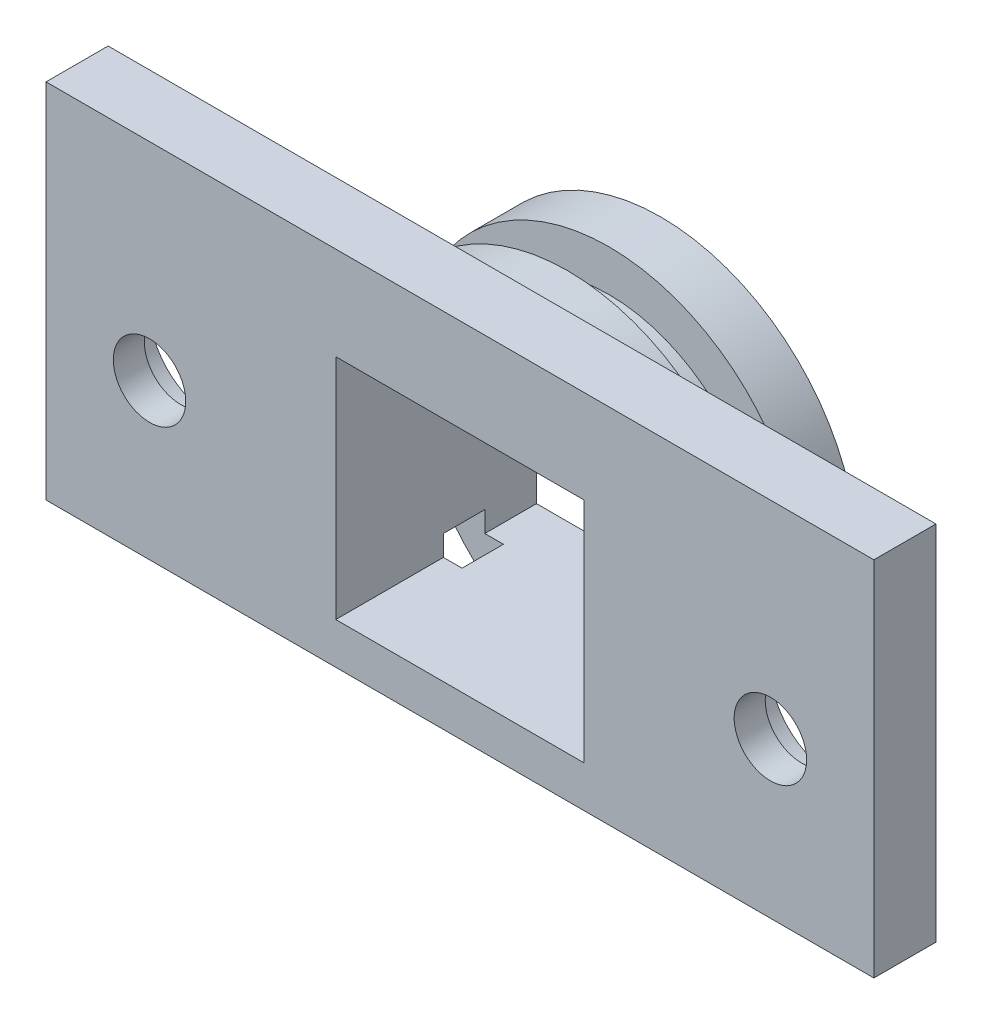
ISO-10303-21;
HEADER;
FILE_DESCRIPTION(('STEP AP214'),'2;1');
FILE_NAME('part.step','',(''),(''),'','','');
FILE_SCHEMA(('AUTOMOTIVE_DESIGN { 1 0 10303 214 1 1 1 1 }'));
ENDSEC;
DATA;
#1=APPLICATION_CONTEXT('core data for automotive mechanical design processes');
#2=APPLICATION_PROTOCOL_DEFINITION('international standard','automotive_design',2000,#1);
#3=PRODUCT_CONTEXT('',#1,'mechanical');
#4=PRODUCT('Part','Part','',(#3));
#5=PRODUCT_RELATED_PRODUCT_CATEGORY('part','',(#4));
#6=PRODUCT_DEFINITION_FORMATION('','',#4);
#7=PRODUCT_DEFINITION_CONTEXT('part definition',#1,'design');
#8=PRODUCT_DEFINITION('design','',#6,#7);
#9=PRODUCT_DEFINITION_SHAPE('','',#8);
#10=(LENGTH_UNIT() NAMED_UNIT(*) SI_UNIT(.MILLI.,.METRE.));
#11=(NAMED_UNIT(*) PLANE_ANGLE_UNIT() SI_UNIT($,.RADIAN.));
#12=(NAMED_UNIT(*) SI_UNIT($,.STERADIAN.) SOLID_ANGLE_UNIT());
#13=UNCERTAINTY_MEASURE_WITH_UNIT(LENGTH_MEASURE(1.E-05),#10,'distance_accuracy_value','');
#14=(GEOMETRIC_REPRESENTATION_CONTEXT(3) GLOBAL_UNCERTAINTY_ASSIGNED_CONTEXT((#13)) GLOBAL_UNIT_ASSIGNED_CONTEXT((#10,
#11,#12)) REPRESENTATION_CONTEXT('',''));
#15=CARTESIAN_POINT('',(0.,0.,0.));
#16=DIRECTION('',(0.,0.,1.));
#17=DIRECTION('',(1.,0.,0.));
#18=AXIS2_PLACEMENT_3D('',#15,#16,#17);
#19=CARTESIAN_POINT('',(15.,0.,-6.7));
#20=DIRECTION('',(0.,0.,1.));
#21=DIRECTION('',(1.,0.,0.));
#22=AXIS2_PLACEMENT_3D('',#19,#20,#21);
#23=CYLINDRICAL_SURFACE('',#22,1.75);
#24=CARTESIAN_POINT('',(15.,0.,3.));
#25=DIRECTION('',(0.,0.,1.));
#26=DIRECTION('',(1.,0.,0.));
#27=AXIS2_PLACEMENT_3D('',#24,#25,#26);
#28=CIRCLE('',#27,1.75);
#29=CARTESIAN_POINT('',(16.75,0.,3.));
#30=VERTEX_POINT('',#29);
#31=EDGE_CURVE('E417',#30,#30,#28,.T.);
#32=ORIENTED_EDGE('',*,*,#31,.T.);
#33=EDGE_LOOP('',(#32));
#34=FACE_BOUND('',#33,.T.);
#35=CARTESIAN_POINT('',(15.,0.,1.5));
#36=DIRECTION('',(0.,0.,-1.));
#37=DIRECTION('',(-1.,0.,0.));
#38=AXIS2_PLACEMENT_3D('',#35,#36,#37);
#39=CIRCLE('',#38,1.75);
#40=CARTESIAN_POINT('',(13.25,0.,1.5));
#41=VERTEX_POINT('',#40);
#42=EDGE_CURVE('E43',#41,#41,#39,.F.);
#43=ORIENTED_EDGE('',*,*,#42,.F.);
#44=EDGE_LOOP('',(#43));
#45=FACE_BOUND('',#44,.T.);
#46=ADVANCED_FACE('F39',(#34,#45),#23,.F.);
#47=CARTESIAN_POINT('',(-15.,0.,-6.7));
#48=DIRECTION('',(0.,0.,1.));
#49=DIRECTION('',(1.,0.,0.));
#50=AXIS2_PLACEMENT_3D('',#47,#48,#49);
#51=CYLINDRICAL_SURFACE('',#50,1.75);
#52=CARTESIAN_POINT('',(-15.,0.,3.));
#53=DIRECTION('',(0.,0.,1.));
#54=DIRECTION('',(1.,0.,0.));
#55=AXIS2_PLACEMENT_3D('',#52,#53,#54);
#56=CIRCLE('',#55,1.75);
#57=CARTESIAN_POINT('',(-13.25,0.,3.));
#58=VERTEX_POINT('',#57);
#59=EDGE_CURVE('E438',#58,#58,#56,.T.);
#60=ORIENTED_EDGE('',*,*,#59,.T.);
#61=EDGE_LOOP('',(#60));
#62=FACE_BOUND('',#61,.T.);
#63=CARTESIAN_POINT('',(-15.,0.,1.5));
#64=DIRECTION('',(0.,0.,-1.));
#65=DIRECTION('',(-1.,0.,0.));
#66=AXIS2_PLACEMENT_3D('',#63,#64,#65);
#67=CIRCLE('',#66,1.75);
#68=CARTESIAN_POINT('',(-16.75,0.,1.5));
#69=VERTEX_POINT('',#68);
#70=EDGE_CURVE('E408',#69,#69,#67,.F.);
#71=ORIENTED_EDGE('',*,*,#70,.F.);
#72=EDGE_LOOP('',(#71));
#73=FACE_BOUND('',#72,.T.);
#74=ADVANCED_FACE('F563',(#62,#73),#51,.F.);
#75=CARTESIAN_POINT('',(0.,0.,-2.2));
#76=DIRECTION('',(0.,0.,1.));
#77=DIRECTION('',(1.,0.,0.));
#78=AXIS2_PLACEMENT_3D('',#75,#76,#77);
#79=PLANE('',#78);
#80=DIRECTION('',(0.,-1.,0.));
#81=VECTOR('',#80,1.);
#82=CARTESIAN_POINT('',(6.,0.,-2.2));
#83=LINE('',#82,#81);
#84=CARTESIAN_POINT('',(6.,5.5,-2.2));
#85=VERTEX_POINT('',#84);
#86=CARTESIAN_POINT('',(6.,4.5,-2.2));
#87=VERTEX_POINT('',#86);
#88=EDGE_CURVE('E350',#85,#87,#83,.T.);
#89=ORIENTED_EDGE('',*,*,#88,.F.);
#90=DIRECTION('',(1.,0.,0.));
#91=VECTOR('',#90,1.);
#92=CARTESIAN_POINT('',(0.,5.5,-2.2));
#93=LINE('',#92,#91);
#94=CARTESIAN_POINT('',(5.09901951359279,5.5,-2.2));
#95=VERTEX_POINT('',#94);
#96=EDGE_CURVE('E339',#95,#85,#93,.T.);
#97=ORIENTED_EDGE('',*,*,#96,.F.);
#98=CARTESIAN_POINT('',(0.,0.,-2.2));
#99=DIRECTION('',(0.,0.,-1.));
#100=DIRECTION('',(-1.,0.,0.));
#101=AXIS2_PLACEMENT_3D('',#98,#99,#100);
#102=CIRCLE('',#101,7.5);
#103=CARTESIAN_POINT('',(-5.09901951359279,5.5,-2.2));
#104=VERTEX_POINT('',#103);
#105=EDGE_CURVE('E496',#104,#95,#102,.T.);
#106=ORIENTED_EDGE('',*,*,#105,.F.);
#107=CARTESIAN_POINT('',(-6.,5.5,-2.2));
#108=VERTEX_POINT('',#107);
#109=EDGE_CURVE('E336',#108,#104,#93,.T.);
#110=ORIENTED_EDGE('',*,*,#109,.F.);
#111=DIRECTION('',(0.,-1.,0.));
#112=VECTOR('',#111,1.);
#113=CARTESIAN_POINT('',(-6.,0.,-2.2));
#114=LINE('',#113,#112);
#115=CARTESIAN_POINT('',(-6.,4.5,-2.2));
#116=VERTEX_POINT('',#115);
#117=EDGE_CURVE('E319',#108,#116,#114,.T.);
#118=ORIENTED_EDGE('',*,*,#117,.T.);
#119=CARTESIAN_POINT('',(-6.,-4.5,-2.2));
#120=VERTEX_POINT('',#119);
#121=EDGE_CURVE('E393',#120,#116,#102,.T.);
#122=ORIENTED_EDGE('',*,*,#121,.F.);
#123=CARTESIAN_POINT('',(-6.,-5.5,-2.2));
#124=VERTEX_POINT('',#123);
#125=EDGE_CURVE('E323',#120,#124,#114,.T.);
#126=ORIENTED_EDGE('',*,*,#125,.T.);
#127=DIRECTION('',(1.,0.,0.));
#128=VECTOR('',#127,1.);
#129=CARTESIAN_POINT('',(0.,-5.5,-2.2));
#130=LINE('',#129,#128);
#131=CARTESIAN_POINT('',(-5.09901951359279,-5.5,-2.2));
#132=VERTEX_POINT('',#131);
#133=EDGE_CURVE('E301',#124,#132,#130,.T.);
#134=ORIENTED_EDGE('',*,*,#133,.T.);
#135=CARTESIAN_POINT('',(0.,-7.5,-2.2));
#136=VERTEX_POINT('',#135);
#137=EDGE_CURVE('E389',#136,#132,#102,.T.);
#138=ORIENTED_EDGE('',*,*,#137,.F.);
#139=DIRECTION('',(1.,0.,0.));
#140=VECTOR('',#139,1.);
#141=CARTESIAN_POINT('',(-5.8309518948453,-7.5,-2.2));
#142=LINE('',#141,#140);
#143=CARTESIAN_POINT('',(-5.8309518948453,-7.5,-2.2));
#144=VERTEX_POINT('',#143);
#145=EDGE_CURVE('E399',#144,#136,#142,.T.);
#146=ORIENTED_EDGE('',*,*,#145,.F.);
#147=CARTESIAN_POINT('',(0.,0.,-2.2));
#148=DIRECTION('',(0.,0.,1.));
#149=DIRECTION('',(1.,0.,0.));
#150=AXIS2_PLACEMENT_3D('',#147,#148,#149);
#151=CIRCLE('',#150,9.5);
#152=CARTESIAN_POINT('',(5.8309518948453,-7.5,-2.2));
#153=VERTEX_POINT('',#152);
#154=EDGE_CURVE('E394',#153,#144,#151,.T.);
#155=ORIENTED_EDGE('',*,*,#154,.F.);
#156=EDGE_CURVE('E398',#136,#153,#142,.T.);
#157=ORIENTED_EDGE('',*,*,#156,.F.);
#158=CARTESIAN_POINT('',(5.09901951359279,-5.5,-2.2));
#159=VERTEX_POINT('',#158);
#160=EDGE_CURVE('E381',#159,#136,#102,.T.);
#161=ORIENTED_EDGE('',*,*,#160,.F.);
#162=CARTESIAN_POINT('',(6.,-5.5,-2.2));
#163=VERTEX_POINT('',#162);
#164=EDGE_CURVE('E305',#159,#163,#130,.T.);
#165=ORIENTED_EDGE('',*,*,#164,.T.);
#166=CARTESIAN_POINT('',(6.,-4.5,-2.2));
#167=VERTEX_POINT('',#166);
#168=EDGE_CURVE('E353',#167,#163,#83,.T.);
#169=ORIENTED_EDGE('',*,*,#168,.F.);
#170=EDGE_CURVE('E480',#87,#167,#102,.T.);
#171=ORIENTED_EDGE('',*,*,#170,.F.);
#172=EDGE_LOOP('',(#89,#97,#106,#110,#118,#122,#126,#134,#138,#146,#155,#157,#161,#165,#169,#171));
#173=FACE_BOUND('',#172,.T.);
#174=ADVANCED_FACE('F470',(#173),#79,.F.);
#175=CARTESIAN_POINT('',(0.,0.,-4.2));
#176=DIRECTION('',(0.,0.,1.));
#177=DIRECTION('',(1.,0.,0.));
#178=AXIS2_PLACEMENT_3D('',#175,#176,#177);
#179=CYLINDRICAL_SURFACE('',#178,7.5);
#180=DIRECTION('',(0.,0.,1.));
#181=VECTOR('',#180,1.);
#182=CARTESIAN_POINT('',(6.,-4.5,-4.2));
#183=LINE('',#182,#181);
#184=CARTESIAN_POINT('',(6.,-4.5,-4.2));
#185=VERTEX_POINT('',#184);
#186=EDGE_CURVE('E354',#185,#167,#183,.T.);
#187=ORIENTED_EDGE('',*,*,#186,.F.);
#188=CARTESIAN_POINT('',(0.,0.,-4.2));
#189=DIRECTION('',(0.,0.,-1.));
#190=DIRECTION('',(-1.,0.,0.));
#191=AXIS2_PLACEMENT_3D('',#188,#189,#190);
#192=CIRCLE('',#191,7.5);
#193=CARTESIAN_POINT('',(6.,4.5,-4.2));
#194=VERTEX_POINT('',#193);
#195=EDGE_CURVE('E490',#194,#185,#192,.T.);
#196=ORIENTED_EDGE('',*,*,#195,.F.);
#197=DIRECTION('',(0.,0.,1.));
#198=VECTOR('',#197,1.);
#199=CARTESIAN_POINT('',(6.,4.5,-4.2));
#200=LINE('',#199,#198);
#201=EDGE_CURVE('E346',#87,#194,#200,.F.);
#202=ORIENTED_EDGE('',*,*,#201,.F.);
#203=ORIENTED_EDGE('',*,*,#170,.T.);
#204=EDGE_LOOP('',(#187,#196,#202,#203));
#205=FACE_BOUND('',#204,.T.);
#206=ADVANCED_FACE('F535',(#205),#179,.T.);
#207=DIRECTION('',(0.,0.,1.));
#208=VECTOR('',#207,1.);
#209=CARTESIAN_POINT('',(5.09901951359279,5.5,-4.2));
#210=LINE('',#209,#208);
#211=CARTESIAN_POINT('',(5.09901951359279,5.5,-4.2));
#212=VERTEX_POINT('',#211);
#213=EDGE_CURVE('E340',#212,#95,#210,.T.);
#214=ORIENTED_EDGE('',*,*,#213,.F.);
#215=CARTESIAN_POINT('',(-5.09901951359279,5.5,-4.2));
#216=VERTEX_POINT('',#215);
#217=EDGE_CURVE('E487',#216,#212,#192,.T.);
#218=ORIENTED_EDGE('',*,*,#217,.F.);
#219=DIRECTION('',(0.,0.,1.));
#220=VECTOR('',#219,1.);
#221=CARTESIAN_POINT('',(-5.09901951359279,5.5,-4.2));
#222=LINE('',#221,#220);
#223=EDGE_CURVE('E332',#104,#216,#222,.F.);
#224=ORIENTED_EDGE('',*,*,#223,.F.);
#225=ORIENTED_EDGE('',*,*,#105,.T.);
#226=EDGE_LOOP('',(#214,#218,#224,#225));
#227=FACE_BOUND('',#226,.T.);
#228=ADVANCED_FACE('F545',(#227),#179,.T.);
#229=CARTESIAN_POINT('',(-6.,-4.5,-4.2));
#230=VERTEX_POINT('',#229);
#231=CARTESIAN_POINT('',(-6.,4.5,-4.2));
#232=VERTEX_POINT('',#231);
#233=EDGE_CURVE('E387',#230,#232,#192,.T.);
#234=ORIENTED_EDGE('',*,*,#233,.F.);
#235=DIRECTION('',(0.,0.,1.));
#236=VECTOR('',#235,1.);
#237=CARTESIAN_POINT('',(-6.,-4.5,-4.2));
#238=LINE('',#237,#236);
#239=EDGE_CURVE('E324',#230,#120,#238,.T.);
#240=ORIENTED_EDGE('',*,*,#239,.T.);
#241=ORIENTED_EDGE('',*,*,#121,.T.);
#242=DIRECTION('',(0.,0.,1.));
#243=VECTOR('',#242,1.);
#244=CARTESIAN_POINT('',(-6.,4.5,-4.2));
#245=LINE('',#244,#243);
#246=EDGE_CURVE('E314',#116,#232,#245,.F.);
#247=ORIENTED_EDGE('',*,*,#246,.T.);
#248=EDGE_LOOP('',(#234,#240,#241,#247));
#249=FACE_BOUND('',#248,.T.);
#250=ADVANCED_FACE('F550',(#249),#179,.T.);
#251=CARTESIAN_POINT('',(0.,0.,-4.2));
#252=DIRECTION('',(0.,0.,-1.));
#253=DIRECTION('',(-1.,0.,0.));
#254=AXIS2_PLACEMENT_3D('',#251,#252,#253);
#255=PLANE('',#254);
#256=DIRECTION('',(0.,1.,0.));
#257=VECTOR('',#256,1.);
#258=CARTESIAN_POINT('',(6.,0.,-4.2));
#259=LINE('',#258,#257);
#260=CARTESIAN_POINT('',(6.,5.5,-4.2));
#261=VERTEX_POINT('',#260);
#262=EDGE_CURVE('E343',#194,#261,#259,.T.);
#263=ORIENTED_EDGE('',*,*,#262,.F.);
#264=ORIENTED_EDGE('',*,*,#195,.T.);
#265=CARTESIAN_POINT('',(6.,-5.5,-4.2));
#266=VERTEX_POINT('',#265);
#267=EDGE_CURVE('E347',#266,#185,#259,.T.);
#268=ORIENTED_EDGE('',*,*,#267,.F.);
#269=DIRECTION('',(-1.,0.,0.));
#270=VECTOR('',#269,1.);
#271=CARTESIAN_POINT('',(0.,-5.5,-4.2));
#272=LINE('',#271,#270);
#273=CARTESIAN_POINT('',(5.09901951359279,-5.5,-4.2));
#274=VERTEX_POINT('',#273);
#275=EDGE_CURVE('E297',#266,#274,#272,.T.);
#276=ORIENTED_EDGE('',*,*,#275,.T.);
#277=CARTESIAN_POINT('',(0.,-7.5,-4.2));
#278=VERTEX_POINT('',#277);
#279=EDGE_CURVE('E388',#274,#278,#192,.T.);
#280=ORIENTED_EDGE('',*,*,#279,.T.);
#281=DIRECTION('',(-1.,0.,0.));
#282=VECTOR('',#281,1.);
#283=CARTESIAN_POINT('',(5.8309518948453,-7.5,-4.2));
#284=LINE('',#283,#282);
#285=CARTESIAN_POINT('',(5.8309518948453,-7.5,-4.2));
#286=VERTEX_POINT('',#285);
#287=EDGE_CURVE('E362',#286,#278,#284,.T.);
#288=ORIENTED_EDGE('',*,*,#287,.F.);
#289=CARTESIAN_POINT('',(0.,0.,-4.2));
#290=DIRECTION('',(0.,0.,-1.));
#291=DIRECTION('',(-1.,0.,0.));
#292=AXIS2_PLACEMENT_3D('',#289,#290,#291);
#293=CIRCLE('',#292,9.5);
#294=CARTESIAN_POINT('',(-5.8309518948453,-7.5,-4.2));
#295=VERTEX_POINT('',#294);
#296=EDGE_CURVE('E366',#295,#286,#293,.T.);
#297=ORIENTED_EDGE('',*,*,#296,.F.);
#298=EDGE_CURVE('E370',#278,#295,#284,.T.);
#299=ORIENTED_EDGE('',*,*,#298,.F.);
#300=CARTESIAN_POINT('',(-5.09901951359279,-5.5,-4.2));
#301=VERTEX_POINT('',#300);
#302=EDGE_CURVE('E382',#278,#301,#192,.T.);
#303=ORIENTED_EDGE('',*,*,#302,.T.);
#304=CARTESIAN_POINT('',(-6.,-5.5,-4.2));
#305=VERTEX_POINT('',#304);
#306=EDGE_CURVE('E292',#301,#305,#272,.T.);
#307=ORIENTED_EDGE('',*,*,#306,.T.);
#308=DIRECTION('',(0.,1.,0.));
#309=VECTOR('',#308,1.);
#310=CARTESIAN_POINT('',(-6.,0.,-4.2));
#311=LINE('',#310,#309);
#312=EDGE_CURVE('E315',#305,#230,#311,.T.);
#313=ORIENTED_EDGE('',*,*,#312,.T.);
#314=ORIENTED_EDGE('',*,*,#233,.T.);
#315=CARTESIAN_POINT('',(-6.,5.5,-4.2));
#316=VERTEX_POINT('',#315);
#317=EDGE_CURVE('E310',#232,#316,#311,.T.);
#318=ORIENTED_EDGE('',*,*,#317,.T.);
#319=DIRECTION('',(-1.,0.,0.));
#320=VECTOR('',#319,1.);
#321=CARTESIAN_POINT('',(0.,5.5,-4.2));
#322=LINE('',#321,#320);
#323=EDGE_CURVE('E328',#216,#316,#322,.T.);
#324=ORIENTED_EDGE('',*,*,#323,.F.);
#325=ORIENTED_EDGE('',*,*,#217,.T.);
#326=EDGE_CURVE('E333',#261,#212,#322,.T.);
#327=ORIENTED_EDGE('',*,*,#326,.F.);
#328=EDGE_LOOP('',(#263,#264,#268,#276,#280,#288,#297,#299,#303,#307,#313,#314,#318,#324,#325,#327));
#329=FACE_BOUND('',#328,.T.);
#330=ADVANCED_FACE('F526',(#329),#255,.F.);
#331=CARTESIAN_POINT('',(0.,0.,-6.7));
#332=DIRECTION('',(0.,0.,-1.));
#333=DIRECTION('',(-1.,0.,0.));
#334=AXIS2_PLACEMENT_3D('',#331,#332,#333);
#335=PLANE('',#334);
#336=CARTESIAN_POINT('',(0.,0.,-6.7));
#337=DIRECTION('',(0.,0.,-1.));
#338=DIRECTION('',(-1.,0.,0.));
#339=AXIS2_PLACEMENT_3D('',#336,#337,#338);
#340=CIRCLE('',#339,9.5);
#341=CARTESIAN_POINT('',(-5.8309518948453,-7.5,-6.7));
#342=VERTEX_POINT('',#341);
#343=CARTESIAN_POINT('',(5.8309518948453,-7.5,-6.7));
#344=VERTEX_POINT('',#343);
#345=EDGE_CURVE('E357',#342,#344,#340,.T.);
#346=ORIENTED_EDGE('',*,*,#345,.T.);
#347=DIRECTION('',(-1.,0.,0.));
#348=VECTOR('',#347,1.);
#349=CARTESIAN_POINT('',(5.8309518948453,-7.5,-6.7));
#350=LINE('',#349,#348);
#351=EDGE_CURVE('E361',#344,#342,#350,.T.);
#352=ORIENTED_EDGE('',*,*,#351,.T.);
#353=EDGE_LOOP('',(#346,#352));
#354=FACE_BOUND('',#353,.T.);
#355=DIRECTION('',(-1.,0.,0.));
#356=VECTOR('',#355,1.);
#357=CARTESIAN_POINT('',(6.,-5.5,-6.7));
#358=LINE('',#357,#356);
#359=CARTESIAN_POINT('',(6.,-5.5,-6.7));
#360=VERTEX_POINT('',#359);
#361=CARTESIAN_POINT('',(-6.,-5.5,-6.7));
#362=VERTEX_POINT('',#361);
#363=EDGE_CURVE('E269',#360,#362,#358,.T.);
#364=ORIENTED_EDGE('',*,*,#363,.F.);
#365=DIRECTION('',(0.,1.,0.));
#366=VECTOR('',#365,1.);
#367=CARTESIAN_POINT('',(6.,-5.5,-6.7));
#368=LINE('',#367,#366);
#369=CARTESIAN_POINT('',(6.,5.5,-6.7));
#370=VERTEX_POINT('',#369);
#371=EDGE_CURVE('E257',#360,#370,#368,.T.);
#372=ORIENTED_EDGE('',*,*,#371,.T.);
#373=DIRECTION('',(-1.,0.,0.));
#374=VECTOR('',#373,1.);
#375=CARTESIAN_POINT('',(6.,5.5,-6.7));
#376=LINE('',#375,#374);
#377=CARTESIAN_POINT('',(-6.,5.5,-6.7));
#378=VERTEX_POINT('',#377);
#379=EDGE_CURVE('E261',#370,#378,#376,.T.);
#380=ORIENTED_EDGE('',*,*,#379,.T.);
#381=DIRECTION('',(0.,1.,0.));
#382=VECTOR('',#381,1.);
#383=CARTESIAN_POINT('',(-6.,-5.5,-6.7));
#384=LINE('',#383,#382);
#385=EDGE_CURVE('E265',#362,#378,#384,.T.);
#386=ORIENTED_EDGE('',*,*,#385,.F.);
#387=EDGE_LOOP('',(#364,#372,#380,#386));
#388=FACE_BOUND('',#387,.T.);
#389=ADVANCED_FACE('F522',(#354,#388),#335,.T.);
#390=CARTESIAN_POINT('',(0.,0.,-2.2));
#391=DIRECTION('',(0.,0.,1.));
#392=DIRECTION('',(1.,0.,0.));
#393=AXIS2_PLACEMENT_3D('',#390,#391,#392);
#394=CYLINDRICAL_SURFACE('',#393,9.5);
#395=CARTESIAN_POINT('',(0.,0.,0.));
#396=DIRECTION('',(0.,0.,1.));
#397=DIRECTION('',(1.,0.,0.));
#398=AXIS2_PLACEMENT_3D('',#395,#396,#397);
#399=CIRCLE('',#398,9.5);
#400=CARTESIAN_POINT('',(5.8309518948453,-7.50000000000001,0.));
#401=VERTEX_POINT('',#400);
#402=CARTESIAN_POINT('',(-5.8309518948453,-7.50000000000001,0.));
#403=VERTEX_POINT('',#402);
#404=EDGE_CURVE('E386',#401,#403,#399,.T.);
#405=ORIENTED_EDGE('',*,*,#404,.F.);
#406=DIRECTION('',(0.,0.,1.));
#407=VECTOR('',#406,1.);
#408=CARTESIAN_POINT('',(5.8309518948453,-7.5,-2.2));
#409=LINE('',#408,#407);
#410=EDGE_CURVE('E11',#153,#401,#409,.T.);
#411=ORIENTED_EDGE('',*,*,#410,.F.);
#412=ORIENTED_EDGE('',*,*,#154,.T.);
#413=DIRECTION('',(0.,0.,1.));
#414=VECTOR('',#413,1.);
#415=CARTESIAN_POINT('',(-5.8309518948453,-7.5,-2.2));
#416=LINE('',#415,#414);
#417=EDGE_CURVE('E49',#144,#403,#416,.T.);
#418=ORIENTED_EDGE('',*,*,#417,.T.);
#419=EDGE_LOOP('',(#405,#411,#412,#418));
#420=FACE_BOUND('',#419,.T.);
#421=ADVANCED_FACE('F41',(#420),#394,.T.);
#422=CARTESIAN_POINT('',(-5.8309518948453,-7.5,-2.2));
#423=DIRECTION('',(0.,-1.,0.));
#424=DIRECTION('',(0.,0.,-1.));
#425=AXIS2_PLACEMENT_3D('',#422,#423,#424);
#426=PLANE('',#425);
#427=ORIENTED_EDGE('',*,*,#410,.T.);
#428=DIRECTION('',(1.,0.,0.));
#429=VECTOR('',#428,1.);
#430=CARTESIAN_POINT('',(0.,-7.50000000000001,0.));
#431=LINE('',#430,#429);
#432=CARTESIAN_POINT('',(20.,-7.50000000000001,0.));
#433=VERTEX_POINT('',#432);
#434=EDGE_CURVE('E209',#401,#433,#431,.T.);
#435=ORIENTED_EDGE('',*,*,#434,.T.);
#436=DIRECTION('',(0.,0.,-1.));
#437=VECTOR('',#436,1.);
#438=CARTESIAN_POINT('',(20.,-7.50000000000001,3.));
#439=LINE('',#438,#437);
#440=CARTESIAN_POINT('',(20.,-7.50000000000001,3.));
#441=VERTEX_POINT('',#440);
#442=EDGE_CURVE('E207',#441,#433,#439,.T.);
#443=ORIENTED_EDGE('',*,*,#442,.F.);
#444=DIRECTION('',(1.,0.,0.));
#445=VECTOR('',#444,1.);
#446=CARTESIAN_POINT('',(-20.,-7.5,3.));
#447=LINE('',#446,#445);
#448=CARTESIAN_POINT('',(-20.,-7.5,3.));
#449=VERTEX_POINT('',#448);
#450=EDGE_CURVE('E57',#449,#441,#447,.T.);
#451=ORIENTED_EDGE('',*,*,#450,.F.);
#452=DIRECTION('',(0.,0.,-1.));
#453=VECTOR('',#452,1.);
#454=CARTESIAN_POINT('',(-20.,-7.5,3.));
#455=LINE('',#454,#453);
#456=CARTESIAN_POINT('',(-20.,-7.5,0.));
#457=VERTEX_POINT('',#456);
#458=EDGE_CURVE('E214',#449,#457,#455,.T.);
#459=ORIENTED_EDGE('',*,*,#458,.T.);
#460=EDGE_CURVE('E437',#457,#403,#431,.T.);
#461=ORIENTED_EDGE('',*,*,#460,.T.);
#462=ORIENTED_EDGE('',*,*,#417,.F.);
#463=ORIENTED_EDGE('',*,*,#145,.T.);
#464=ORIENTED_EDGE('',*,*,#156,.T.);
#465=EDGE_LOOP('',(#427,#435,#443,#451,#459,#461,#462,#463,#464));
#466=FACE_BOUND('',#465,.T.);
#467=ADVANCED_FACE('F208',(#466),#426,.T.);
#468=ORIENTED_EDGE('',*,*,#302,.F.);
#469=ORIENTED_EDGE('',*,*,#279,.F.);
#470=DIRECTION('',(0.,0.,1.));
#471=VECTOR('',#470,1.);
#472=CARTESIAN_POINT('',(5.09901951359279,-5.5,-4.2));
#473=LINE('',#472,#471);
#474=EDGE_CURVE('E306',#274,#159,#473,.T.);
#475=ORIENTED_EDGE('',*,*,#474,.T.);
#476=ORIENTED_EDGE('',*,*,#160,.T.);
#477=ORIENTED_EDGE('',*,*,#137,.T.);
#478=DIRECTION('',(0.,0.,1.));
#479=VECTOR('',#478,1.);
#480=CARTESIAN_POINT('',(-5.09901951359279,-5.5,-4.2));
#481=LINE('',#480,#479);
#482=EDGE_CURVE('E296',#132,#301,#481,.F.);
#483=ORIENTED_EDGE('',*,*,#482,.T.);
#484=EDGE_LOOP('',(#468,#469,#475,#476,#477,#483));
#485=FACE_BOUND('',#484,.T.);
#486=ADVANCED_FACE('F475',(#485),#179,.T.);
#487=CARTESIAN_POINT('',(0.,0.,-6.7));
#488=DIRECTION('',(0.,0.,1.));
#489=DIRECTION('',(1.,0.,0.));
#490=AXIS2_PLACEMENT_3D('',#487,#488,#489);
#491=CYLINDRICAL_SURFACE('',#490,9.5);
#492=ORIENTED_EDGE('',*,*,#296,.T.);
#493=DIRECTION('',(0.,0.,1.));
#494=VECTOR('',#493,1.);
#495=CARTESIAN_POINT('',(5.8309518948453,-7.5,-6.7));
#496=LINE('',#495,#494);
#497=EDGE_CURVE('E377',#344,#286,#496,.T.);
#498=ORIENTED_EDGE('',*,*,#497,.F.);
#499=ORIENTED_EDGE('',*,*,#345,.F.);
#500=DIRECTION('',(0.,0.,1.));
#501=VECTOR('',#500,1.);
#502=CARTESIAN_POINT('',(-5.8309518948453,-7.5,-6.7));
#503=LINE('',#502,#501);
#504=EDGE_CURVE('E365',#342,#295,#503,.T.);
#505=ORIENTED_EDGE('',*,*,#504,.T.);
#506=EDGE_LOOP('',(#492,#498,#499,#505));
#507=FACE_BOUND('',#506,.T.);
#508=ADVANCED_FACE('F561',(#507),#491,.T.);
#509=CARTESIAN_POINT('',(5.8309518948453,-7.5,-6.7));
#510=DIRECTION('',(0.,1.,0.));
#511=DIRECTION('',(0.,0.,1.));
#512=AXIS2_PLACEMENT_3D('',#509,#510,#511);
#513=PLANE('',#512);
#514=ORIENTED_EDGE('',*,*,#287,.T.);
#515=ORIENTED_EDGE('',*,*,#298,.T.);
#516=ORIENTED_EDGE('',*,*,#504,.F.);
#517=ORIENTED_EDGE('',*,*,#351,.F.);
#518=ORIENTED_EDGE('',*,*,#497,.T.);
#519=EDGE_LOOP('',(#514,#515,#516,#517,#518));
#520=FACE_BOUND('',#519,.T.);
#521=ADVANCED_FACE('F600',(#520),#513,.F.);
#522=CARTESIAN_POINT('',(6.,-5.5,0.));
#523=DIRECTION('',(-1.,0.,0.));
#524=DIRECTION('',(0.,0.,1.));
#525=AXIS2_PLACEMENT_3D('',#522,#523,#524);
#526=PLANE('',#525);
#527=ORIENTED_EDGE('',*,*,#168,.T.);
#528=DIRECTION('',(0.,0.,-1.));
#529=VECTOR('',#528,1.);
#530=CARTESIAN_POINT('',(6.,-5.5,0.));
#531=LINE('',#530,#529);
#532=CARTESIAN_POINT('',(6.,-5.5,3.));
#533=VERTEX_POINT('',#532);
#534=EDGE_CURVE('E274',#533,#163,#531,.T.);
#535=ORIENTED_EDGE('',*,*,#534,.F.);
#536=DIRECTION('',(0.,1.,0.));
#537=VECTOR('',#536,1.);
#538=CARTESIAN_POINT('',(6.,-5.5,3.));
#539=LINE('',#538,#537);
#540=CARTESIAN_POINT('',(6.,5.5,3.));
#541=VERTEX_POINT('',#540);
#542=EDGE_CURVE('E449',#533,#541,#539,.T.);
#543=ORIENTED_EDGE('',*,*,#542,.T.);
#544=DIRECTION('',(0.,0.,-1.));
#545=VECTOR('',#544,1.);
#546=CARTESIAN_POINT('',(6.,5.5,0.));
#547=LINE('',#546,#545);
#548=EDGE_CURVE('E288',#541,#85,#547,.T.);
#549=ORIENTED_EDGE('',*,*,#548,.T.);
#550=ORIENTED_EDGE('',*,*,#88,.T.);
#551=ORIENTED_EDGE('',*,*,#201,.T.);
#552=ORIENTED_EDGE('',*,*,#262,.T.);
#553=EDGE_CURVE('E65',#261,#370,#547,.T.);
#554=ORIENTED_EDGE('',*,*,#553,.T.);
#555=ORIENTED_EDGE('',*,*,#371,.F.);
#556=EDGE_CURVE('E273',#266,#360,#531,.T.);
#557=ORIENTED_EDGE('',*,*,#556,.F.);
#558=ORIENTED_EDGE('',*,*,#267,.T.);
#559=ORIENTED_EDGE('',*,*,#186,.T.);
#560=EDGE_LOOP('',(#527,#535,#543,#549,#550,#551,#552,#554,#555,#557,#558,#559));
#561=FACE_BOUND('',#560,.T.);
#562=ADVANCED_FACE('F532',(#561),#526,.T.);
#563=CARTESIAN_POINT('',(6.,5.5,0.));
#564=DIRECTION('',(0.,-1.,0.));
#565=DIRECTION('',(0.,0.,-1.));
#566=AXIS2_PLACEMENT_3D('',#563,#564,#565);
#567=PLANE('',#566);
#568=ORIENTED_EDGE('',*,*,#96,.T.);
#569=ORIENTED_EDGE('',*,*,#548,.F.);
#570=DIRECTION('',(-1.,0.,0.));
#571=VECTOR('',#570,1.);
#572=CARTESIAN_POINT('',(6.,5.5,3.));
#573=LINE('',#572,#571);
#574=CARTESIAN_POINT('',(-6.,5.5,3.));
#575=VERTEX_POINT('',#574);
#576=EDGE_CURVE('E452',#541,#575,#573,.T.);
#577=ORIENTED_EDGE('',*,*,#576,.T.);
#578=DIRECTION('',(0.,0.,-1.));
#579=VECTOR('',#578,1.);
#580=CARTESIAN_POINT('',(-6.,5.5,0.));
#581=LINE('',#580,#579);
#582=EDGE_CURVE('E284',#575,#108,#581,.T.);
#583=ORIENTED_EDGE('',*,*,#582,.T.);
#584=ORIENTED_EDGE('',*,*,#109,.T.);
#585=ORIENTED_EDGE('',*,*,#223,.T.);
#586=ORIENTED_EDGE('',*,*,#323,.T.);
#587=EDGE_CURVE('E283',#316,#378,#581,.T.);
#588=ORIENTED_EDGE('',*,*,#587,.T.);
#589=ORIENTED_EDGE('',*,*,#379,.F.);
#590=ORIENTED_EDGE('',*,*,#553,.F.);
#591=ORIENTED_EDGE('',*,*,#326,.T.);
#592=ORIENTED_EDGE('',*,*,#213,.T.);
#593=EDGE_LOOP('',(#568,#569,#577,#583,#584,#585,#586,#588,#589,#590,#591,#592));
#594=FACE_BOUND('',#593,.T.);
#595=ADVANCED_FACE('F539',(#594),#567,.T.);
#596=CARTESIAN_POINT('',(-6.,-5.5,0.));
#597=DIRECTION('',(-1.,0.,0.));
#598=DIRECTION('',(0.,0.,1.));
#599=AXIS2_PLACEMENT_3D('',#596,#597,#598);
#600=PLANE('',#599);
#601=ORIENTED_EDGE('',*,*,#239,.F.);
#602=ORIENTED_EDGE('',*,*,#312,.F.);
#603=DIRECTION('',(0.,0.,-1.));
#604=VECTOR('',#603,1.);
#605=CARTESIAN_POINT('',(-6.,-5.5,0.));
#606=LINE('',#605,#604);
#607=EDGE_CURVE('E278',#305,#362,#606,.T.);
#608=ORIENTED_EDGE('',*,*,#607,.T.);
#609=ORIENTED_EDGE('',*,*,#385,.T.);
#610=ORIENTED_EDGE('',*,*,#587,.F.);
#611=ORIENTED_EDGE('',*,*,#317,.F.);
#612=ORIENTED_EDGE('',*,*,#246,.F.);
#613=ORIENTED_EDGE('',*,*,#117,.F.);
#614=ORIENTED_EDGE('',*,*,#582,.F.);
#615=DIRECTION('',(0.,-1.,0.));
#616=VECTOR('',#615,1.);
#617=CARTESIAN_POINT('',(-6.,-5.5,3.));
#618=LINE('',#617,#616);
#619=CARTESIAN_POINT('',(-6.,-5.5,3.));
#620=VERTEX_POINT('',#619);
#621=EDGE_CURVE('E241',#575,#620,#618,.T.);
#622=ORIENTED_EDGE('',*,*,#621,.T.);
#623=EDGE_CURVE('E279',#620,#124,#606,.T.);
#624=ORIENTED_EDGE('',*,*,#623,.T.);
#625=ORIENTED_EDGE('',*,*,#125,.F.);
#626=EDGE_LOOP('',(#601,#602,#608,#609,#610,#611,#612,#613,#614,#622,#624,#625));
#627=FACE_BOUND('',#626,.T.);
#628=ADVANCED_FACE('F461',(#627),#600,.F.);
#629=CARTESIAN_POINT('',(6.,-5.5,0.));
#630=DIRECTION('',(0.,-1.,0.));
#631=DIRECTION('',(0.,0.,-1.));
#632=AXIS2_PLACEMENT_3D('',#629,#630,#631);
#633=PLANE('',#632);
#634=ORIENTED_EDGE('',*,*,#474,.F.);
#635=ORIENTED_EDGE('',*,*,#275,.F.);
#636=ORIENTED_EDGE('',*,*,#556,.T.);
#637=ORIENTED_EDGE('',*,*,#363,.T.);
#638=ORIENTED_EDGE('',*,*,#607,.F.);
#639=ORIENTED_EDGE('',*,*,#306,.F.);
#640=ORIENTED_EDGE('',*,*,#482,.F.);
#641=ORIENTED_EDGE('',*,*,#133,.F.);
#642=ORIENTED_EDGE('',*,*,#623,.F.);
#643=DIRECTION('',(1.,0.,0.));
#644=VECTOR('',#643,1.);
#645=CARTESIAN_POINT('',(6.,-5.5,3.));
#646=LINE('',#645,#644);
#647=EDGE_CURVE('E442',#620,#533,#646,.T.);
#648=ORIENTED_EDGE('',*,*,#647,.T.);
#649=ORIENTED_EDGE('',*,*,#534,.T.);
#650=ORIENTED_EDGE('',*,*,#164,.F.);
#651=EDGE_LOOP('',(#634,#635,#636,#637,#638,#639,#640,#641,#642,#648,#649,#650));
#652=FACE_BOUND('',#651,.T.);
#653=ADVANCED_FACE('F465',(#652),#633,.F.);
#654=CARTESIAN_POINT('',(0.,0.,3.));
#655=DIRECTION('',(0.,0.,-1.));
#656=DIRECTION('',(-1.,0.,0.));
#657=AXIS2_PLACEMENT_3D('',#654,#655,#656);
#658=PLANE('',#657);
#659=ORIENTED_EDGE('',*,*,#59,.F.);
#660=EDGE_LOOP('',(#659));
#661=FACE_BOUND('',#660,.T.);
#662=ORIENTED_EDGE('',*,*,#31,.F.);
#663=EDGE_LOOP('',(#662));
#664=FACE_BOUND('',#663,.T.);
#665=DIRECTION('',(0.,-1.,0.));
#666=VECTOR('',#665,1.);
#667=CARTESIAN_POINT('',(-20.,-10.,3.));
#668=LINE('',#667,#666);
#669=CARTESIAN_POINT('',(-20.,10.,3.));
#670=VERTEX_POINT('',#669);
#671=EDGE_CURVE('E223',#670,#449,#668,.T.);
#672=ORIENTED_EDGE('',*,*,#671,.T.);
#673=ORIENTED_EDGE('',*,*,#450,.T.);
#674=DIRECTION('',(0.,1.,0.));
#675=VECTOR('',#674,1.);
#676=CARTESIAN_POINT('',(20.,-10.,3.));
#677=LINE('',#676,#675);
#678=CARTESIAN_POINT('',(20.,10.,3.));
#679=VERTEX_POINT('',#678);
#680=EDGE_CURVE('E220',#441,#679,#677,.T.);
#681=ORIENTED_EDGE('',*,*,#680,.T.);
#682=DIRECTION('',(-1.,0.,0.));
#683=VECTOR('',#682,1.);
#684=CARTESIAN_POINT('',(-20.,10.,3.));
#685=LINE('',#684,#683);
#686=EDGE_CURVE('E231',#679,#670,#685,.T.);
#687=ORIENTED_EDGE('',*,*,#686,.T.);
#688=EDGE_LOOP('',(#672,#673,#681,#687));
#689=FACE_BOUND('',#688,.T.);
#690=ORIENTED_EDGE('',*,*,#647,.F.);
#691=ORIENTED_EDGE('',*,*,#621,.F.);
#692=ORIENTED_EDGE('',*,*,#576,.F.);
#693=ORIENTED_EDGE('',*,*,#542,.F.);
#694=EDGE_LOOP('',(#690,#691,#692,#693));
#695=FACE_BOUND('',#694,.T.);
#696=ADVANCED_FACE('F218',(#661,#664,#689,#695),#658,.F.);
#697=CARTESIAN_POINT('',(0.,0.,0.));
#698=DIRECTION('',(0.,0.,-1.));
#699=DIRECTION('',(-1.,0.,0.));
#700=AXIS2_PLACEMENT_3D('',#697,#698,#699);
#701=PLANE('',#700);
#702=ORIENTED_EDGE('',*,*,#460,.F.);
#703=DIRECTION('',(0.,-1.,0.));
#704=VECTOR('',#703,1.);
#705=CARTESIAN_POINT('',(-20.,-10.,0.));
#706=LINE('',#705,#704);
#707=CARTESIAN_POINT('',(-20.,10.,0.));
#708=VERTEX_POINT('',#707);
#709=EDGE_CURVE('E232',#708,#457,#706,.T.);
#710=ORIENTED_EDGE('',*,*,#709,.F.);
#711=DIRECTION('',(-1.,0.,0.));
#712=VECTOR('',#711,1.);
#713=CARTESIAN_POINT('',(-20.,10.,0.));
#714=LINE('',#713,#712);
#715=CARTESIAN_POINT('',(20.,10.,0.));
#716=VERTEX_POINT('',#715);
#717=EDGE_CURVE('E238',#716,#708,#714,.T.);
#718=ORIENTED_EDGE('',*,*,#717,.F.);
#719=DIRECTION('',(0.,1.,0.));
#720=VECTOR('',#719,1.);
#721=CARTESIAN_POINT('',(20.,-10.,0.));
#722=LINE('',#721,#720);
#723=EDGE_CURVE('E247',#433,#716,#722,.T.);
#724=ORIENTED_EDGE('',*,*,#723,.F.);
#725=ORIENTED_EDGE('',*,*,#434,.F.);
#726=ORIENTED_EDGE('',*,*,#404,.T.);
#727=EDGE_LOOP('',(#702,#710,#718,#724,#725,#726));
#728=FACE_BOUND('',#727,.T.);
#729=CARTESIAN_POINT('',(-15.,0.,0.));
#730=DIRECTION('',(0.,0.,-1.));
#731=DIRECTION('',(-1.,0.,0.));
#732=AXIS2_PLACEMENT_3D('',#729,#730,#731);
#733=CIRCLE('',#732,3.);
#734=CARTESIAN_POINT('',(-18.,0.,0.));
#735=VERTEX_POINT('',#734);
#736=EDGE_CURVE('E419',#735,#735,#733,.T.);
#737=ORIENTED_EDGE('',*,*,#736,.F.);
#738=EDGE_LOOP('',(#737));
#739=FACE_BOUND('',#738,.T.);
#740=CARTESIAN_POINT('',(15.,0.,0.));
#741=DIRECTION('',(0.,0.,-1.));
#742=DIRECTION('',(-1.,0.,0.));
#743=AXIS2_PLACEMENT_3D('',#740,#741,#742);
#744=CIRCLE('',#743,3.);
#745=CARTESIAN_POINT('',(12.,0.,0.));
#746=VERTEX_POINT('',#745);
#747=EDGE_CURVE('E433',#746,#746,#744,.T.);
#748=ORIENTED_EDGE('',*,*,#747,.F.);
#749=EDGE_LOOP('',(#748));
#750=FACE_BOUND('',#749,.T.);
#751=ADVANCED_FACE('F576',(#728,#739,#750),#701,.T.);
#752=CARTESIAN_POINT('',(20.,-10.,3.));
#753=DIRECTION('',(-1.,0.,0.));
#754=DIRECTION('',(0.,0.,1.));
#755=AXIS2_PLACEMENT_3D('',#752,#753,#754);
#756=PLANE('',#755);
#757=ORIENTED_EDGE('',*,*,#680,.F.);
#758=ORIENTED_EDGE('',*,*,#442,.T.);
#759=ORIENTED_EDGE('',*,*,#723,.T.);
#760=DIRECTION('',(0.,0.,-1.));
#761=VECTOR('',#760,1.);
#762=CARTESIAN_POINT('',(20.,10.,3.));
#763=LINE('',#762,#761);
#764=EDGE_CURVE('E229',#679,#716,#763,.T.);
#765=ORIENTED_EDGE('',*,*,#764,.F.);
#766=EDGE_LOOP('',(#757,#758,#759,#765));
#767=FACE_BOUND('',#766,.T.);
#768=ADVANCED_FACE('F227',(#767),#756,.F.);
#769=CARTESIAN_POINT('',(-20.,10.,3.));
#770=DIRECTION('',(0.,-1.,0.));
#771=DIRECTION('',(0.,0.,-1.));
#772=AXIS2_PLACEMENT_3D('',#769,#770,#771);
#773=PLANE('',#772);
#774=ORIENTED_EDGE('',*,*,#717,.T.);
#775=DIRECTION('',(0.,0.,-1.));
#776=VECTOR('',#775,1.);
#777=CARTESIAN_POINT('',(-20.,10.,3.));
#778=LINE('',#777,#776);
#779=EDGE_CURVE('E246',#670,#708,#778,.T.);
#780=ORIENTED_EDGE('',*,*,#779,.F.);
#781=ORIENTED_EDGE('',*,*,#686,.F.);
#782=ORIENTED_EDGE('',*,*,#764,.T.);
#783=EDGE_LOOP('',(#774,#780,#781,#782));
#784=FACE_BOUND('',#783,.T.);
#785=ADVANCED_FACE('F585',(#784),#773,.F.);
#786=CARTESIAN_POINT('',(-20.,-10.,3.));
#787=DIRECTION('',(1.,0.,0.));
#788=DIRECTION('',(0.,0.,-1.));
#789=AXIS2_PLACEMENT_3D('',#786,#787,#788);
#790=PLANE('',#789);
#791=ORIENTED_EDGE('',*,*,#709,.T.);
#792=ORIENTED_EDGE('',*,*,#458,.F.);
#793=ORIENTED_EDGE('',*,*,#671,.F.);
#794=ORIENTED_EDGE('',*,*,#779,.T.);
#795=EDGE_LOOP('',(#791,#792,#793,#794));
#796=FACE_BOUND('',#795,.T.);
#797=ADVANCED_FACE('F581',(#796),#790,.F.);
#798=CARTESIAN_POINT('',(-15.,0.,1.5));
#799=DIRECTION('',(0.,0.,-1.));
#800=DIRECTION('',(-1.,0.,0.));
#801=AXIS2_PLACEMENT_3D('',#798,#799,#800);
#802=PLANE('',#801);
#803=CARTESIAN_POINT('',(-15.,0.,1.5));
#804=DIRECTION('',(0.,0.,-1.));
#805=DIRECTION('',(-1.,0.,0.));
#806=AXIS2_PLACEMENT_3D('',#803,#804,#805);
#807=CIRCLE('',#806,3.);
#808=CARTESIAN_POINT('',(-18.,0.,1.5));
#809=VERTEX_POINT('',#808);
#810=EDGE_CURVE('E411',#809,#809,#807,.T.);
#811=ORIENTED_EDGE('',*,*,#810,.T.);
#812=EDGE_LOOP('',(#811));
#813=FACE_BOUND('',#812,.T.);
#814=ORIENTED_EDGE('',*,*,#70,.T.);
#815=EDGE_LOOP('',(#814));
#816=FACE_BOUND('',#815,.T.);
#817=ADVANCED_FACE('F584',(#813,#816),#802,.T.);
#818=CARTESIAN_POINT('',(-15.,0.,1.5));
#819=DIRECTION('',(0.,0.,-1.));
#820=DIRECTION('',(-1.,0.,0.));
#821=AXIS2_PLACEMENT_3D('',#818,#819,#820);
#822=CYLINDRICAL_SURFACE('',#821,3.);
#823=ORIENTED_EDGE('',*,*,#810,.F.);
#824=EDGE_LOOP('',(#823));
#825=FACE_BOUND('',#824,.T.);
#826=ORIENTED_EDGE('',*,*,#736,.T.);
#827=EDGE_LOOP('',(#826));
#828=FACE_BOUND('',#827,.T.);
#829=ADVANCED_FACE('F664',(#825,#828),#822,.F.);
#830=CARTESIAN_POINT('',(15.,0.,1.5));
#831=DIRECTION('',(0.,0.,-1.));
#832=DIRECTION('',(-1.,0.,0.));
#833=AXIS2_PLACEMENT_3D('',#830,#831,#832);
#834=PLANE('',#833);
#835=CARTESIAN_POINT('',(15.,0.,1.5));
#836=DIRECTION('',(0.,0.,-1.));
#837=DIRECTION('',(-1.,0.,0.));
#838=AXIS2_PLACEMENT_3D('',#835,#836,#837);
#839=CIRCLE('',#838,3.);
#840=CARTESIAN_POINT('',(12.,0.,1.5));
#841=VERTEX_POINT('',#840);
#842=EDGE_CURVE('E425',#841,#841,#839,.T.);
#843=ORIENTED_EDGE('',*,*,#842,.T.);
#844=EDGE_LOOP('',(#843));
#845=FACE_BOUND('',#844,.T.);
#846=ORIENTED_EDGE('',*,*,#42,.T.);
#847=EDGE_LOOP('',(#846));
#848=FACE_BOUND('',#847,.T.);
#849=ADVANCED_FACE('F672',(#845,#848),#834,.T.);
#850=CARTESIAN_POINT('',(15.,0.,1.5));
#851=DIRECTION('',(0.,0.,-1.));
#852=DIRECTION('',(-1.,0.,0.));
#853=AXIS2_PLACEMENT_3D('',#850,#851,#852);
#854=CYLINDRICAL_SURFACE('',#853,3.);
#855=ORIENTED_EDGE('',*,*,#842,.F.);
#856=EDGE_LOOP('',(#855));
#857=FACE_BOUND('',#856,.T.);
#858=ORIENTED_EDGE('',*,*,#747,.T.);
#859=EDGE_LOOP('',(#858));
#860=FACE_BOUND('',#859,.T.);
#861=ADVANCED_FACE('F680',(#857,#860),#854,.F.);
#862=CLOSED_SHELL('',(#46,#74,#174,#206,#228,#250,#330,#389,#421,#467,#486,#508,#521,#562,#595,
#628,#653,#696,#751,#768,#785,#797,#817,#829,#849,#861));
#863=MANIFOLD_SOLID_BREP('B2',#862);
#864=ADVANCED_BREP_SHAPE_REPRESENTATION('',(#18,#863),#14);
#865=SHAPE_DEFINITION_REPRESENTATION(#9,#864);
ENDSEC;
END-ISO-10303-21;
